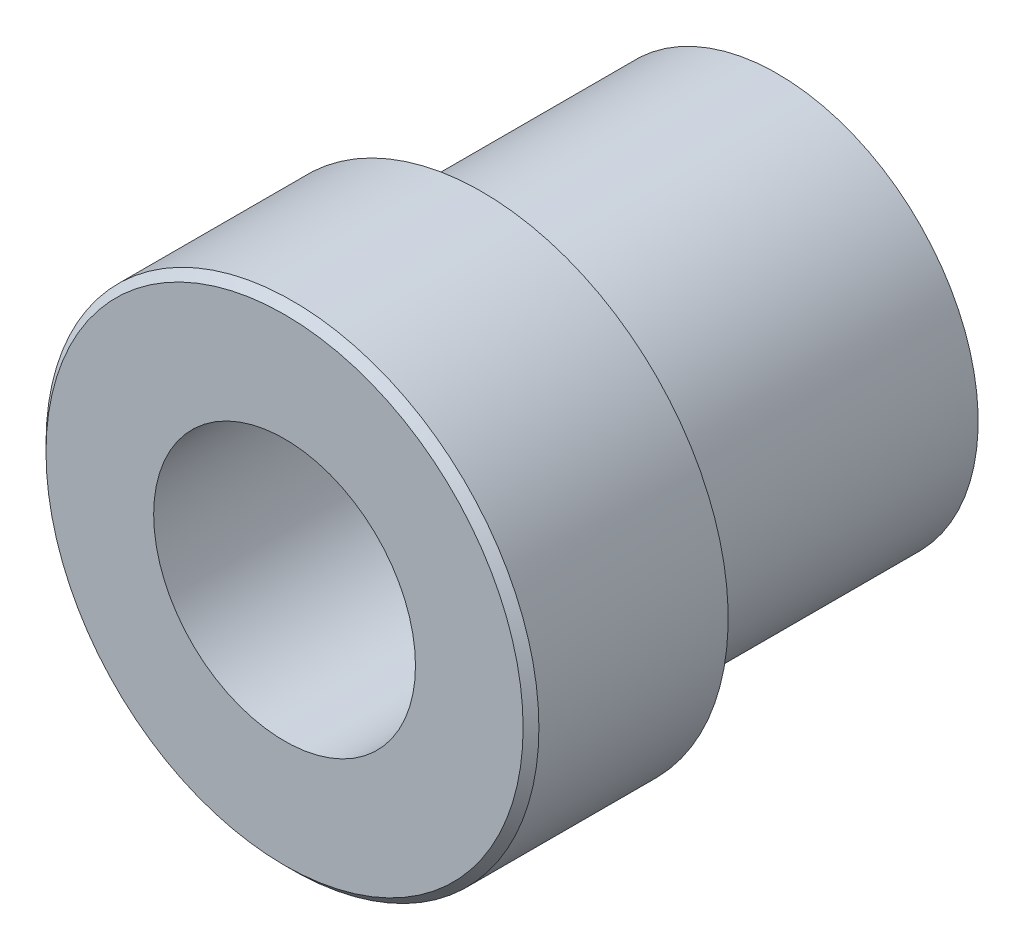
ISO-10303-21;
HEADER;
FILE_DESCRIPTION(('STEP AP214'),'2;1');
FILE_NAME('part.step','',(''),(''),'','','');
FILE_SCHEMA(('AUTOMOTIVE_DESIGN { 1 0 10303 214 1 1 1 1 }'));
ENDSEC;
DATA;
#1=APPLICATION_CONTEXT('core data for automotive mechanical design processes');
#2=APPLICATION_PROTOCOL_DEFINITION('international standard','automotive_design',2000,#1);
#3=PRODUCT_CONTEXT('',#1,'mechanical');
#4=PRODUCT('Part','Part','',(#3));
#5=PRODUCT_RELATED_PRODUCT_CATEGORY('part','',(#4));
#6=PRODUCT_DEFINITION_FORMATION('','',#4);
#7=PRODUCT_DEFINITION_CONTEXT('part definition',#1,'design');
#8=PRODUCT_DEFINITION('design','',#6,#7);
#9=PRODUCT_DEFINITION_SHAPE('','',#8);
#10=(LENGTH_UNIT() NAMED_UNIT(*) SI_UNIT(.MILLI.,.METRE.));
#11=(NAMED_UNIT(*) PLANE_ANGLE_UNIT() SI_UNIT($,.RADIAN.));
#12=(NAMED_UNIT(*) SI_UNIT($,.STERADIAN.) SOLID_ANGLE_UNIT());
#13=UNCERTAINTY_MEASURE_WITH_UNIT(LENGTH_MEASURE(1.E-05),#10,'distance_accuracy_value','');
#14=(GEOMETRIC_REPRESENTATION_CONTEXT(3) GLOBAL_UNCERTAINTY_ASSIGNED_CONTEXT((#13)) GLOBAL_UNIT_ASSIGNED_CONTEXT((#10,
#11,#12)) REPRESENTATION_CONTEXT('',''));
#15=CARTESIAN_POINT('',(0.,0.,0.));
#16=DIRECTION('',(0.,0.,1.));
#17=DIRECTION('',(1.,0.,0.));
#18=AXIS2_PLACEMENT_3D('',#15,#16,#17);
#19=CARTESIAN_POINT('',(0.,0.,15.875));
#20=DIRECTION('',(0.,0.,-1.));
#21=DIRECTION('',(-1.,0.,0.));
#22=AXIS2_PLACEMENT_3D('',#19,#20,#21);
#23=CYLINDRICAL_SURFACE('',#22,7.9375);
#24=CARTESIAN_POINT('',(0.,0.,15.621));
#25=DIRECTION('',(0.,0.,1.));
#26=DIRECTION('',(1.,0.,0.));
#27=AXIS2_PLACEMENT_3D('',#24,#25,#26);
#28=CIRCLE('',#27,7.9375);
#29=CARTESIAN_POINT('',(7.9375,0.,15.621));
#30=VERTEX_POINT('',#29);
#31=EDGE_CURVE('E11',#30,#30,#28,.F.);
#32=ORIENTED_EDGE('',*,*,#31,.T.);
#33=EDGE_LOOP('',(#32));
#34=FACE_BOUND('',#33,.T.);
#35=CARTESIAN_POINT('',(0.,0.,9.525));
#36=DIRECTION('',(0.,0.,-1.));
#37=DIRECTION('',(-1.,0.,0.));
#38=AXIS2_PLACEMENT_3D('',#35,#36,#37);
#39=CIRCLE('',#38,7.9375);
#40=CARTESIAN_POINT('',(-7.9375,0.,9.525));
#41=VERTEX_POINT('',#40);
#42=EDGE_CURVE('E37',#41,#41,#39,.T.);
#43=ORIENTED_EDGE('',*,*,#42,.F.);
#44=EDGE_LOOP('',(#43));
#45=FACE_BOUND('',#44,.T.);
#46=ADVANCED_FACE('F33',(#34,#45),#23,.T.);
#47=CARTESIAN_POINT('',(0.,0.,15.875));
#48=DIRECTION('',(0.,0.,1.));
#49=DIRECTION('',(1.,0.,0.));
#50=AXIS2_PLACEMENT_3D('',#47,#48,#49);
#51=PLANE('',#50);
#52=CARTESIAN_POINT('',(0.,0.,15.875));
#53=DIRECTION('',(0.,0.,1.));
#54=DIRECTION('',(1.,0.,0.));
#55=AXIS2_PLACEMENT_3D('',#52,#53,#54);
#56=CIRCLE('',#55,4.2164);
#57=CARTESIAN_POINT('',(4.2164,0.,15.875));
#58=VERTEX_POINT('',#57);
#59=EDGE_CURVE('E56',#58,#58,#56,.T.);
#60=ORIENTED_EDGE('',*,*,#59,.F.);
#61=EDGE_LOOP('',(#60));
#62=FACE_BOUND('',#61,.T.);
#63=CARTESIAN_POINT('',(0.,0.,15.875));
#64=DIRECTION('',(0.,0.,1.));
#65=DIRECTION('',(1.,0.,0.));
#66=AXIS2_PLACEMENT_3D('',#63,#64,#65);
#67=CIRCLE('',#66,7.6835);
#68=CARTESIAN_POINT('',(7.6835,0.,15.875));
#69=VERTEX_POINT('',#68);
#70=EDGE_CURVE('E41',#69,#69,#67,.T.);
#71=ORIENTED_EDGE('',*,*,#70,.T.);
#72=EDGE_LOOP('',(#71));
#73=FACE_BOUND('',#72,.T.);
#74=ADVANCED_FACE('F62',(#62,#73),#51,.T.);
#75=CARTESIAN_POINT('',(0.,0.,15.875));
#76=DIRECTION('',(0.,0.,-1.));
#77=DIRECTION('',(-1.,0.,0.));
#78=AXIS2_PLACEMENT_3D('',#75,#76,#77);
#79=CONICAL_SURFACE('',#78,7.6835,0.785398163397442);
#80=ORIENTED_EDGE('',*,*,#31,.F.);
#81=EDGE_LOOP('',(#80));
#82=FACE_BOUND('',#81,.T.);
#83=ORIENTED_EDGE('',*,*,#70,.F.);
#84=EDGE_LOOP('',(#83));
#85=FACE_BOUND('',#84,.T.);
#86=ADVANCED_FACE('F35',(#82,#85),#79,.T.);
#87=CARTESIAN_POINT('',(0.,0.,9.525));
#88=DIRECTION('',(0.,0.,-1.));
#89=DIRECTION('',(-1.,0.,0.));
#90=AXIS2_PLACEMENT_3D('',#87,#88,#89);
#91=PLANE('',#90);
#92=CARTESIAN_POINT('',(0.,0.,9.525));
#93=DIRECTION('',(0.,0.,-1.));
#94=DIRECTION('',(-1.,0.,0.));
#95=AXIS2_PLACEMENT_3D('',#92,#93,#94);
#96=CIRCLE('',#95,6.4643);
#97=CARTESIAN_POINT('',(-6.4643,0.,9.525));
#98=VERTEX_POINT('',#97);
#99=EDGE_CURVE('E50',#98,#98,#96,.T.);
#100=ORIENTED_EDGE('',*,*,#99,.F.);
#101=EDGE_LOOP('',(#100));
#102=FACE_BOUND('',#101,.T.);
#103=ORIENTED_EDGE('',*,*,#42,.T.);
#104=EDGE_LOOP('',(#103));
#105=FACE_BOUND('',#104,.T.);
#106=ADVANCED_FACE('F69',(#102,#105),#91,.T.);
#107=CARTESIAN_POINT('',(0.,0.,9.525));
#108=DIRECTION('',(0.,0.,-1.));
#109=DIRECTION('',(-1.,0.,0.));
#110=AXIS2_PLACEMENT_3D('',#107,#108,#109);
#111=CYLINDRICAL_SURFACE('',#110,6.4643);
#112=ORIENTED_EDGE('',*,*,#99,.T.);
#113=EDGE_LOOP('',(#112));
#114=FACE_BOUND('',#113,.T.);
#115=CARTESIAN_POINT('',(0.,0.,0.));
#116=DIRECTION('',(0.,0.,-1.));
#117=DIRECTION('',(-1.,0.,0.));
#118=AXIS2_PLACEMENT_3D('',#115,#116,#117);
#119=CIRCLE('',#118,6.4643);
#120=CARTESIAN_POINT('',(-6.4643,0.,0.));
#121=VERTEX_POINT('',#120);
#122=EDGE_CURVE('E47',#121,#121,#119,.T.);
#123=ORIENTED_EDGE('',*,*,#122,.F.);
#124=EDGE_LOOP('',(#123));
#125=FACE_BOUND('',#124,.T.);
#126=ADVANCED_FACE('F74',(#114,#125),#111,.T.);
#127=CARTESIAN_POINT('',(0.,0.,0.));
#128=DIRECTION('',(0.,0.,1.));
#129=DIRECTION('',(1.,0.,0.));
#130=AXIS2_PLACEMENT_3D('',#127,#128,#129);
#131=PLANE('',#130);
#132=CARTESIAN_POINT('',(0.,0.,0.));
#133=DIRECTION('',(0.,0.,1.));
#134=DIRECTION('',(1.,0.,0.));
#135=AXIS2_PLACEMENT_3D('',#132,#133,#134);
#136=CIRCLE('',#135,4.2164);
#137=CARTESIAN_POINT('',(4.2164,0.,0.));
#138=VERTEX_POINT('',#137);
#139=EDGE_CURVE('E51',#138,#138,#136,.T.);
#140=ORIENTED_EDGE('',*,*,#139,.T.);
#141=EDGE_LOOP('',(#140));
#142=FACE_BOUND('',#141,.T.);
#143=ORIENTED_EDGE('',*,*,#122,.T.);
#144=EDGE_LOOP('',(#143));
#145=FACE_BOUND('',#144,.T.);
#146=ADVANCED_FACE('F82',(#142,#145),#131,.F.);
#147=CARTESIAN_POINT('',(0.,0.,15.875));
#148=DIRECTION('',(0.,0.,1.));
#149=DIRECTION('',(1.,0.,0.));
#150=AXIS2_PLACEMENT_3D('',#147,#148,#149);
#151=CYLINDRICAL_SURFACE('',#150,4.2164);
#152=ORIENTED_EDGE('',*,*,#139,.F.);
#153=EDGE_LOOP('',(#152));
#154=FACE_BOUND('',#153,.T.);
#155=ORIENTED_EDGE('',*,*,#59,.T.);
#156=EDGE_LOOP('',(#155));
#157=FACE_BOUND('',#156,.T.);
#158=ADVANCED_FACE('F60',(#154,#157),#151,.F.);
#159=CLOSED_SHELL('',(#46,#74,#86,#106,#126,#146,#158));
#160=MANIFOLD_SOLID_BREP('B2',#159);
#161=ADVANCED_BREP_SHAPE_REPRESENTATION('',(#18,#160),#14);
#162=SHAPE_DEFINITION_REPRESENTATION(#9,#161);
ENDSEC;
END-ISO-10303-21;
